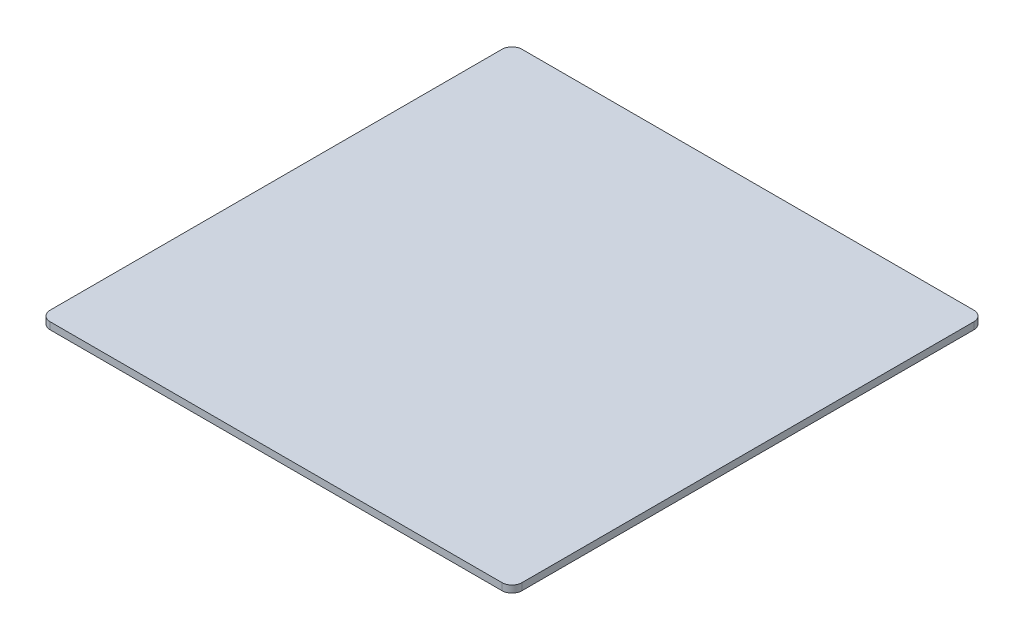
ISO-10303-21;
HEADER;
FILE_DESCRIPTION(('STEP AP214'),'2;1');
FILE_NAME('part.step','',(''),(''),'','','');
FILE_SCHEMA(('AUTOMOTIVE_DESIGN { 1 0 10303 214 1 1 1 1 }'));
ENDSEC;
DATA;
#1=APPLICATION_CONTEXT('core data for automotive mechanical design processes');
#2=APPLICATION_PROTOCOL_DEFINITION('international standard','automotive_design',2000,#1);
#3=PRODUCT_CONTEXT('',#1,'mechanical');
#4=PRODUCT('Part','Part','',(#3));
#5=PRODUCT_RELATED_PRODUCT_CATEGORY('part','',(#4));
#6=PRODUCT_DEFINITION_FORMATION('','',#4);
#7=PRODUCT_DEFINITION_CONTEXT('part definition',#1,'design');
#8=PRODUCT_DEFINITION('design','',#6,#7);
#9=PRODUCT_DEFINITION_SHAPE('','',#8);
#10=(LENGTH_UNIT() NAMED_UNIT(*) SI_UNIT(.MILLI.,.METRE.));
#11=(NAMED_UNIT(*) PLANE_ANGLE_UNIT() SI_UNIT($,.RADIAN.));
#12=(NAMED_UNIT(*) SI_UNIT($,.STERADIAN.) SOLID_ANGLE_UNIT());
#13=UNCERTAINTY_MEASURE_WITH_UNIT(LENGTH_MEASURE(1.E-05),#10,'distance_accuracy_value','');
#14=(GEOMETRIC_REPRESENTATION_CONTEXT(3) GLOBAL_UNCERTAINTY_ASSIGNED_CONTEXT((#13)) GLOBAL_UNIT_ASSIGNED_CONTEXT((#10,
#11,#12)) REPRESENTATION_CONTEXT('',''));
#15=CARTESIAN_POINT('',(0.,0.,0.));
#16=DIRECTION('',(0.,0.,1.));
#17=DIRECTION('',(1.,0.,0.));
#18=AXIS2_PLACEMENT_3D('',#15,#16,#17);
#19=CARTESIAN_POINT('',(85.,1.,85.));
#20=DIRECTION('',(0.,-1.,0.));
#21=DIRECTION('',(0.,0.,-1.));
#22=AXIS2_PLACEMENT_3D('',#19,#20,#21);
#23=PLANE('',#22);
#24=CARTESIAN_POINT('',(85.,1.,85.));
#25=DIRECTION('',(0.,-1.,0.));
#26=DIRECTION('',(0.,0.,-1.));
#27=AXIS2_PLACEMENT_3D('',#24,#25,#26);
#28=CIRCLE('',#27,2.);
#29=CARTESIAN_POINT('',(85.,1.,83.));
#30=VERTEX_POINT('',#29);
#31=EDGE_CURVE('E11',#30,#30,#28,.T.);
#32=ORIENTED_EDGE('',*,*,#31,.T.);
#33=EDGE_LOOP('',(#32));
#34=FACE_BOUND('',#33,.T.);
#35=ADVANCED_FACE('F38',(#34),#23,.T.);
#36=CARTESIAN_POINT('',(85.,1.,85.));
#37=DIRECTION('',(0.,-1.,0.));
#38=DIRECTION('',(0.,0.,-1.));
#39=AXIS2_PLACEMENT_3D('',#36,#37,#38);
#40=CYLINDRICAL_SURFACE('',#39,2.);
#41=ORIENTED_EDGE('',*,*,#31,.F.);
#42=EDGE_LOOP('',(#41));
#43=FACE_BOUND('',#42,.T.);
#44=CARTESIAN_POINT('',(85.,0.,85.));
#45=DIRECTION('',(0.,-1.,0.));
#46=DIRECTION('',(0.,0.,-1.));
#47=AXIS2_PLACEMENT_3D('',#44,#45,#46);
#48=CIRCLE('',#47,2.);
#49=CARTESIAN_POINT('',(85.,0.,83.));
#50=VERTEX_POINT('',#49);
#51=EDGE_CURVE('E46',#50,#50,#48,.T.);
#52=ORIENTED_EDGE('',*,*,#51,.T.);
#53=EDGE_LOOP('',(#52));
#54=FACE_BOUND('',#53,.T.);
#55=ADVANCED_FACE('F204',(#43,#54),#40,.F.);
#56=CARTESIAN_POINT('',(85.,1.,-85.));
#57=DIRECTION('',(0.,-1.,0.));
#58=DIRECTION('',(0.,0.,-1.));
#59=AXIS2_PLACEMENT_3D('',#56,#57,#58);
#60=PLANE('',#59);
#61=CARTESIAN_POINT('',(85.,1.,-85.));
#62=DIRECTION('',(0.,-1.,0.));
#63=DIRECTION('',(0.,0.,-1.));
#64=AXIS2_PLACEMENT_3D('',#61,#62,#63);
#65=CIRCLE('',#64,2.);
#66=CARTESIAN_POINT('',(85.,1.,-87.));
#67=VERTEX_POINT('',#66);
#68=EDGE_CURVE('E197',#67,#67,#65,.T.);
#69=ORIENTED_EDGE('',*,*,#68,.T.);
#70=EDGE_LOOP('',(#69));
#71=FACE_BOUND('',#70,.T.);
#72=ADVANCED_FACE('F229',(#71),#60,.T.);
#73=CARTESIAN_POINT('',(85.,1.,-85.));
#74=DIRECTION('',(0.,-1.,0.));
#75=DIRECTION('',(0.,0.,-1.));
#76=AXIS2_PLACEMENT_3D('',#73,#74,#75);
#77=CYLINDRICAL_SURFACE('',#76,2.);
#78=ORIENTED_EDGE('',*,*,#68,.F.);
#79=EDGE_LOOP('',(#78));
#80=FACE_BOUND('',#79,.T.);
#81=CARTESIAN_POINT('',(85.,0.,-85.));
#82=DIRECTION('',(0.,-1.,0.));
#83=DIRECTION('',(0.,0.,-1.));
#84=AXIS2_PLACEMENT_3D('',#81,#82,#83);
#85=CIRCLE('',#84,2.);
#86=CARTESIAN_POINT('',(85.,0.,-87.));
#87=VERTEX_POINT('',#86);
#88=EDGE_CURVE('E193',#87,#87,#85,.T.);
#89=ORIENTED_EDGE('',*,*,#88,.T.);
#90=EDGE_LOOP('',(#89));
#91=FACE_BOUND('',#90,.T.);
#92=ADVANCED_FACE('F235',(#80,#91),#77,.F.);
#93=CARTESIAN_POINT('',(-117.5,3.5,-117.5));
#94=DIRECTION('',(1.,0.,0.));
#95=DIRECTION('',(0.,0.,-1.));
#96=AXIS2_PLACEMENT_3D('',#93,#94,#95);
#97=PLANE('',#96);
#98=DIRECTION('',(0.,0.,1.));
#99=VECTOR('',#98,1.);
#100=CARTESIAN_POINT('',(-117.5,3.5,-117.5));
#101=LINE('',#100,#99);
#102=CARTESIAN_POINT('',(-117.5,3.5,-112.5));
#103=VERTEX_POINT('',#102);
#104=CARTESIAN_POINT('',(-117.5,3.5,112.5));
#105=VERTEX_POINT('',#104);
#106=EDGE_CURVE('E126',#103,#105,#101,.T.);
#107=ORIENTED_EDGE('',*,*,#106,.F.);
#108=DIRECTION('',(0.,-1.,0.));
#109=VECTOR('',#108,1.);
#110=CARTESIAN_POINT('',(-117.5,3.5,-112.5));
#111=LINE('',#110,#109);
#112=CARTESIAN_POINT('',(-117.5,0.,-112.5));
#113=VERTEX_POINT('',#112);
#114=EDGE_CURVE('E109',#103,#113,#111,.T.);
#115=ORIENTED_EDGE('',*,*,#114,.T.);
#116=DIRECTION('',(0.,0.,1.));
#117=VECTOR('',#116,1.);
#118=CARTESIAN_POINT('',(-117.5,0.,-117.5));
#119=LINE('',#118,#117);
#120=CARTESIAN_POINT('',(-117.5,0.,112.5));
#121=VERTEX_POINT('',#120);
#122=EDGE_CURVE('E123',#113,#121,#119,.T.);
#123=ORIENTED_EDGE('',*,*,#122,.T.);
#124=DIRECTION('',(0.,-1.,0.));
#125=VECTOR('',#124,1.);
#126=CARTESIAN_POINT('',(-117.5,3.5,112.5));
#127=LINE('',#126,#125);
#128=EDGE_CURVE('E129',#121,#105,#127,.F.);
#129=ORIENTED_EDGE('',*,*,#128,.T.);
#130=EDGE_LOOP('',(#107,#115,#123,#129));
#131=FACE_BOUND('',#130,.T.);
#132=ADVANCED_FACE('F122',(#131),#97,.F.);
#133=CARTESIAN_POINT('',(117.5,3.5,117.5));
#134=DIRECTION('',(0.,0.,-1.));
#135=DIRECTION('',(-1.,0.,0.));
#136=AXIS2_PLACEMENT_3D('',#133,#134,#135);
#137=PLANE('',#136);
#138=DIRECTION('',(1.,0.,0.));
#139=VECTOR('',#138,1.);
#140=CARTESIAN_POINT('',(117.5,0.,117.5));
#141=LINE('',#140,#139);
#142=CARTESIAN_POINT('',(-112.5,0.,117.5));
#143=VERTEX_POINT('',#142);
#144=CARTESIAN_POINT('',(112.5,0.,117.5));
#145=VERTEX_POINT('',#144);
#146=EDGE_CURVE('E135',#143,#145,#141,.T.);
#147=ORIENTED_EDGE('',*,*,#146,.T.);
#148=DIRECTION('',(0.,-1.,0.));
#149=VECTOR('',#148,1.);
#150=CARTESIAN_POINT('',(112.5,3.5,117.5));
#151=LINE('',#150,#149);
#152=CARTESIAN_POINT('',(112.5,3.5,117.5));
#153=VERTEX_POINT('',#152);
#154=EDGE_CURVE('E190',#145,#153,#151,.F.);
#155=ORIENTED_EDGE('',*,*,#154,.T.);
#156=DIRECTION('',(1.,0.,0.));
#157=VECTOR('',#156,1.);
#158=CARTESIAN_POINT('',(117.5,3.5,117.5));
#159=LINE('',#158,#157);
#160=CARTESIAN_POINT('',(-112.5,3.5,117.5));
#161=VERTEX_POINT('',#160);
#162=EDGE_CURVE('E274',#161,#153,#159,.T.);
#163=ORIENTED_EDGE('',*,*,#162,.F.);
#164=DIRECTION('',(0.,-1.,0.));
#165=VECTOR('',#164,1.);
#166=CARTESIAN_POINT('',(-112.5,3.5,117.5));
#167=LINE('',#166,#165);
#168=EDGE_CURVE('E186',#161,#143,#167,.T.);
#169=ORIENTED_EDGE('',*,*,#168,.T.);
#170=EDGE_LOOP('',(#147,#155,#163,#169));
#171=FACE_BOUND('',#170,.T.);
#172=ADVANCED_FACE('F255',(#171),#137,.F.);
#173=CARTESIAN_POINT('',(117.5,3.5,-117.5));
#174=DIRECTION('',(-1.,0.,0.));
#175=DIRECTION('',(0.,0.,1.));
#176=AXIS2_PLACEMENT_3D('',#173,#174,#175);
#177=PLANE('',#176);
#178=DIRECTION('',(0.,0.,-1.));
#179=VECTOR('',#178,1.);
#180=CARTESIAN_POINT('',(117.5,0.,-117.5));
#181=LINE('',#180,#179);
#182=CARTESIAN_POINT('',(117.5,0.,112.5));
#183=VERTEX_POINT('',#182);
#184=CARTESIAN_POINT('',(117.5,0.,-112.5));
#185=VERTEX_POINT('',#184);
#186=EDGE_CURVE('E141',#183,#185,#181,.T.);
#187=ORIENTED_EDGE('',*,*,#186,.T.);
#188=DIRECTION('',(0.,-1.,0.));
#189=VECTOR('',#188,1.);
#190=CARTESIAN_POINT('',(117.5,3.5,-112.5));
#191=LINE('',#190,#189);
#192=CARTESIAN_POINT('',(117.5,3.5,-112.5));
#193=VERTEX_POINT('',#192);
#194=EDGE_CURVE('E53',#185,#193,#191,.F.);
#195=ORIENTED_EDGE('',*,*,#194,.T.);
#196=DIRECTION('',(0.,0.,-1.));
#197=VECTOR('',#196,1.);
#198=CARTESIAN_POINT('',(117.5,3.5,-117.5));
#199=LINE('',#198,#197);
#200=CARTESIAN_POINT('',(117.5,3.5,112.5));
#201=VERTEX_POINT('',#200);
#202=EDGE_CURVE('E271',#201,#193,#199,.T.);
#203=ORIENTED_EDGE('',*,*,#202,.F.);
#204=DIRECTION('',(0.,-1.,0.));
#205=VECTOR('',#204,1.);
#206=CARTESIAN_POINT('',(117.5,3.5,112.5));
#207=LINE('',#206,#205);
#208=EDGE_CURVE('E180',#201,#183,#207,.T.);
#209=ORIENTED_EDGE('',*,*,#208,.T.);
#210=EDGE_LOOP('',(#187,#195,#203,#209));
#211=FACE_BOUND('',#210,.T.);
#212=ADVANCED_FACE('F258',(#211),#177,.F.);
#213=CARTESIAN_POINT('',(117.5,3.5,-117.5));
#214=DIRECTION('',(0.,0.,1.));
#215=DIRECTION('',(1.,0.,0.));
#216=AXIS2_PLACEMENT_3D('',#213,#214,#215);
#217=PLANE('',#216);
#218=DIRECTION('',(-1.,0.,0.));
#219=VECTOR('',#218,1.);
#220=CARTESIAN_POINT('',(117.5,0.,-117.5));
#221=LINE('',#220,#219);
#222=CARTESIAN_POINT('',(112.5,0.,-117.5));
#223=VERTEX_POINT('',#222);
#224=CARTESIAN_POINT('',(-112.5,0.,-117.5));
#225=VERTEX_POINT('',#224);
#226=EDGE_CURVE('E152',#223,#225,#221,.T.);
#227=ORIENTED_EDGE('',*,*,#226,.T.);
#228=DIRECTION('',(0.,-1.,0.));
#229=VECTOR('',#228,1.);
#230=CARTESIAN_POINT('',(-112.5,3.5,-117.5));
#231=LINE('',#230,#229);
#232=CARTESIAN_POINT('',(-112.5,3.5,-117.5));
#233=VERTEX_POINT('',#232);
#234=EDGE_CURVE('E110',#225,#233,#231,.F.);
#235=ORIENTED_EDGE('',*,*,#234,.T.);
#236=DIRECTION('',(-1.,0.,0.));
#237=VECTOR('',#236,1.);
#238=CARTESIAN_POINT('',(117.5,3.5,-117.5));
#239=LINE('',#238,#237);
#240=CARTESIAN_POINT('',(112.5,3.5,-117.5));
#241=VERTEX_POINT('',#240);
#242=EDGE_CURVE('E147',#241,#233,#239,.T.);
#243=ORIENTED_EDGE('',*,*,#242,.F.);
#244=DIRECTION('',(0.,-1.,0.));
#245=VECTOR('',#244,1.);
#246=CARTESIAN_POINT('',(112.5,3.5,-117.5));
#247=LINE('',#246,#245);
#248=EDGE_CURVE('E116',#241,#223,#247,.T.);
#249=ORIENTED_EDGE('',*,*,#248,.T.);
#250=EDGE_LOOP('',(#227,#235,#243,#249));
#251=FACE_BOUND('',#250,.T.);
#252=ADVANCED_FACE('F218',(#251),#217,.F.);
#253=CARTESIAN_POINT('',(0.,3.5,0.));
#254=DIRECTION('',(0.,-1.,0.));
#255=DIRECTION('',(0.,0.,-1.));
#256=AXIS2_PLACEMENT_3D('',#253,#254,#255);
#257=PLANE('',#256);
#258=ORIENTED_EDGE('',*,*,#242,.T.);
#259=CARTESIAN_POINT('',(-112.5,3.5,-112.5));
#260=DIRECTION('',(0.,-1.,0.));
#261=DIRECTION('',(0.,0.,-1.));
#262=AXIS2_PLACEMENT_3D('',#259,#260,#261);
#263=CIRCLE('',#262,5.);
#264=EDGE_CURVE('E177',#233,#103,#263,.F.);
#265=ORIENTED_EDGE('',*,*,#264,.T.);
#266=ORIENTED_EDGE('',*,*,#106,.T.);
#267=CARTESIAN_POINT('',(-112.5,3.5,112.5));
#268=DIRECTION('',(0.,-1.,0.));
#269=DIRECTION('',(0.,0.,-1.));
#270=AXIS2_PLACEMENT_3D('',#267,#268,#269);
#271=CIRCLE('',#270,5.);
#272=EDGE_CURVE('E169',#105,#161,#271,.F.);
#273=ORIENTED_EDGE('',*,*,#272,.T.);
#274=ORIENTED_EDGE('',*,*,#162,.T.);
#275=CARTESIAN_POINT('',(112.5,3.5,112.5));
#276=DIRECTION('',(0.,-1.,0.));
#277=DIRECTION('',(0.,0.,-1.));
#278=AXIS2_PLACEMENT_3D('',#275,#276,#277);
#279=CIRCLE('',#278,5.);
#280=EDGE_CURVE('E60',#153,#201,#279,.F.);
#281=ORIENTED_EDGE('',*,*,#280,.T.);
#282=ORIENTED_EDGE('',*,*,#202,.T.);
#283=CARTESIAN_POINT('',(112.5,3.5,-112.5));
#284=DIRECTION('',(0.,-1.,0.));
#285=DIRECTION('',(0.,0.,-1.));
#286=AXIS2_PLACEMENT_3D('',#283,#284,#285);
#287=CIRCLE('',#286,5.);
#288=EDGE_CURVE('E174',#193,#241,#287,.F.);
#289=ORIENTED_EDGE('',*,*,#288,.T.);
#290=EDGE_LOOP('',(#258,#265,#266,#273,#274,#281,#282,#289));
#291=FACE_BOUND('',#290,.T.);
#292=ADVANCED_FACE('F207',(#291),#257,.F.);
#293=CARTESIAN_POINT('',(0.,0.,0.));
#294=DIRECTION('',(0.,-1.,0.));
#295=DIRECTION('',(0.,0.,-1.));
#296=AXIS2_PLACEMENT_3D('',#293,#294,#295);
#297=PLANE('',#296);
#298=CARTESIAN_POINT('',(-85.,0.,85.));
#299=DIRECTION('',(0.,-1.,0.));
#300=DIRECTION('',(0.,0.,-1.));
#301=AXIS2_PLACEMENT_3D('',#298,#299,#300);
#302=CIRCLE('',#301,2.);
#303=CARTESIAN_POINT('',(-85.,0.,83.));
#304=VERTEX_POINT('',#303);
#305=EDGE_CURVE('E287',#304,#304,#302,.T.);
#306=ORIENTED_EDGE('',*,*,#305,.F.);
#307=EDGE_LOOP('',(#306));
#308=FACE_BOUND('',#307,.T.);
#309=CARTESIAN_POINT('',(-85.,0.,-85.));
#310=DIRECTION('',(0.,-1.,0.));
#311=DIRECTION('',(0.,0.,-1.));
#312=AXIS2_PLACEMENT_3D('',#309,#310,#311);
#313=CIRCLE('',#312,2.);
#314=CARTESIAN_POINT('',(-85.,0.,-87.));
#315=VERTEX_POINT('',#314);
#316=EDGE_CURVE('E144',#315,#315,#313,.T.);
#317=ORIENTED_EDGE('',*,*,#316,.F.);
#318=EDGE_LOOP('',(#317));
#319=FACE_BOUND('',#318,.T.);
#320=ORIENTED_EDGE('',*,*,#122,.F.);
#321=CARTESIAN_POINT('',(-112.5,0.,-112.5));
#322=DIRECTION('',(0.,-1.,0.));
#323=DIRECTION('',(0.,0.,-1.));
#324=AXIS2_PLACEMENT_3D('',#321,#322,#323);
#325=CIRCLE('',#324,5.);
#326=EDGE_CURVE('E105',#113,#225,#325,.T.);
#327=ORIENTED_EDGE('',*,*,#326,.T.);
#328=ORIENTED_EDGE('',*,*,#226,.F.);
#329=CARTESIAN_POINT('',(112.5,0.,-112.5));
#330=DIRECTION('',(0.,-1.,0.));
#331=DIRECTION('',(0.,0.,-1.));
#332=AXIS2_PLACEMENT_3D('',#329,#330,#331);
#333=CIRCLE('',#332,5.);
#334=EDGE_CURVE('E117',#223,#185,#333,.T.);
#335=ORIENTED_EDGE('',*,*,#334,.T.);
#336=ORIENTED_EDGE('',*,*,#186,.F.);
#337=CARTESIAN_POINT('',(112.5,0.,112.5));
#338=DIRECTION('',(0.,-1.,0.));
#339=DIRECTION('',(0.,0.,-1.));
#340=AXIS2_PLACEMENT_3D('',#337,#338,#339);
#341=CIRCLE('',#340,5.);
#342=EDGE_CURVE('E159',#183,#145,#341,.T.);
#343=ORIENTED_EDGE('',*,*,#342,.T.);
#344=ORIENTED_EDGE('',*,*,#146,.F.);
#345=CARTESIAN_POINT('',(-112.5,0.,112.5));
#346=DIRECTION('',(0.,-1.,0.));
#347=DIRECTION('',(0.,0.,-1.));
#348=AXIS2_PLACEMENT_3D('',#345,#346,#347);
#349=CIRCLE('',#348,5.);
#350=EDGE_CURVE('E128',#143,#121,#349,.T.);
#351=ORIENTED_EDGE('',*,*,#350,.T.);
#352=EDGE_LOOP('',(#320,#327,#328,#335,#336,#343,#344,#351));
#353=FACE_BOUND('',#352,.T.);
#354=ORIENTED_EDGE('',*,*,#88,.F.);
#355=EDGE_LOOP('',(#354));
#356=FACE_BOUND('',#355,.T.);
#357=ORIENTED_EDGE('',*,*,#51,.F.);
#358=EDGE_LOOP('',(#357));
#359=FACE_BOUND('',#358,.T.);
#360=ADVANCED_FACE('F131',(#308,#319,#353,#356,#359),#297,.T.);
#361=CARTESIAN_POINT('',(-112.5,3.5,-112.5));
#362=DIRECTION('',(0.,-1.,0.));
#363=DIRECTION('',(0.,0.,-1.));
#364=AXIS2_PLACEMENT_3D('',#361,#362,#363);
#365=CYLINDRICAL_SURFACE('',#364,5.);
#366=ORIENTED_EDGE('',*,*,#264,.F.);
#367=ORIENTED_EDGE('',*,*,#234,.F.);
#368=ORIENTED_EDGE('',*,*,#326,.F.);
#369=ORIENTED_EDGE('',*,*,#114,.F.);
#370=EDGE_LOOP('',(#366,#367,#368,#369));
#371=FACE_BOUND('',#370,.T.);
#372=ADVANCED_FACE('F108',(#371),#365,.T.);
#373=CARTESIAN_POINT('',(112.5,3.5,-112.5));
#374=DIRECTION('',(0.,-1.,0.));
#375=DIRECTION('',(0.,0.,-1.));
#376=AXIS2_PLACEMENT_3D('',#373,#374,#375);
#377=CYLINDRICAL_SURFACE('',#376,5.);
#378=ORIENTED_EDGE('',*,*,#288,.F.);
#379=ORIENTED_EDGE('',*,*,#194,.F.);
#380=ORIENTED_EDGE('',*,*,#334,.F.);
#381=ORIENTED_EDGE('',*,*,#248,.F.);
#382=EDGE_LOOP('',(#378,#379,#380,#381));
#383=FACE_BOUND('',#382,.T.);
#384=ADVANCED_FACE('F215',(#383),#377,.T.);
#385=CARTESIAN_POINT('',(112.5,3.5,112.5));
#386=DIRECTION('',(0.,-1.,0.));
#387=DIRECTION('',(0.,0.,-1.));
#388=AXIS2_PLACEMENT_3D('',#385,#386,#387);
#389=CYLINDRICAL_SURFACE('',#388,5.);
#390=ORIENTED_EDGE('',*,*,#280,.F.);
#391=ORIENTED_EDGE('',*,*,#154,.F.);
#392=ORIENTED_EDGE('',*,*,#342,.F.);
#393=ORIENTED_EDGE('',*,*,#208,.F.);
#394=EDGE_LOOP('',(#390,#391,#392,#393));
#395=FACE_BOUND('',#394,.T.);
#396=ADVANCED_FACE('F245',(#395),#389,.T.);
#397=CARTESIAN_POINT('',(-112.5,3.5,112.5));
#398=DIRECTION('',(0.,-1.,0.));
#399=DIRECTION('',(0.,0.,-1.));
#400=AXIS2_PLACEMENT_3D('',#397,#398,#399);
#401=CYLINDRICAL_SURFACE('',#400,5.);
#402=ORIENTED_EDGE('',*,*,#272,.F.);
#403=ORIENTED_EDGE('',*,*,#128,.F.);
#404=ORIENTED_EDGE('',*,*,#350,.F.);
#405=ORIENTED_EDGE('',*,*,#168,.F.);
#406=EDGE_LOOP('',(#402,#403,#404,#405));
#407=FACE_BOUND('',#406,.T.);
#408=ADVANCED_FACE('F242',(#407),#401,.T.);
#409=CARTESIAN_POINT('',(-85.,1.,-85.));
#410=DIRECTION('',(0.,-1.,0.));
#411=DIRECTION('',(0.,0.,-1.));
#412=AXIS2_PLACEMENT_3D('',#409,#410,#411);
#413=CYLINDRICAL_SURFACE('',#412,2.);
#414=CARTESIAN_POINT('',(-85.,1.,-85.));
#415=DIRECTION('',(0.,-1.,0.));
#416=DIRECTION('',(0.,0.,-1.));
#417=AXIS2_PLACEMENT_3D('',#414,#415,#416);
#418=CIRCLE('',#417,2.);
#419=CARTESIAN_POINT('',(-85.,1.,-87.));
#420=VERTEX_POINT('',#419);
#421=EDGE_CURVE('E136',#420,#420,#418,.T.);
#422=ORIENTED_EDGE('',*,*,#421,.F.);
#423=EDGE_LOOP('',(#422));
#424=FACE_BOUND('',#423,.T.);
#425=ORIENTED_EDGE('',*,*,#316,.T.);
#426=EDGE_LOOP('',(#425));
#427=FACE_BOUND('',#426,.T.);
#428=ADVANCED_FACE('F244',(#424,#427),#413,.F.);
#429=CARTESIAN_POINT('',(-85.,1.,-85.));
#430=DIRECTION('',(0.,-1.,0.));
#431=DIRECTION('',(0.,0.,-1.));
#432=AXIS2_PLACEMENT_3D('',#429,#430,#431);
#433=PLANE('',#432);
#434=ORIENTED_EDGE('',*,*,#421,.T.);
#435=EDGE_LOOP('',(#434));
#436=FACE_BOUND('',#435,.T.);
#437=ADVANCED_FACE('F294',(#436),#433,.T.);
#438=CARTESIAN_POINT('',(-85.,1.,85.));
#439=DIRECTION('',(0.,-1.,0.));
#440=DIRECTION('',(0.,0.,-1.));
#441=AXIS2_PLACEMENT_3D('',#438,#439,#440);
#442=CYLINDRICAL_SURFACE('',#441,2.);
#443=CARTESIAN_POINT('',(-85.,1.,85.));
#444=DIRECTION('',(0.,-1.,0.));
#445=DIRECTION('',(0.,0.,-1.));
#446=AXIS2_PLACEMENT_3D('',#443,#444,#445);
#447=CIRCLE('',#446,2.);
#448=CARTESIAN_POINT('',(-85.,1.,83.));
#449=VERTEX_POINT('',#448);
#450=EDGE_CURVE('E282',#449,#449,#447,.T.);
#451=ORIENTED_EDGE('',*,*,#450,.F.);
#452=EDGE_LOOP('',(#451));
#453=FACE_BOUND('',#452,.T.);
#454=ORIENTED_EDGE('',*,*,#305,.T.);
#455=EDGE_LOOP('',(#454));
#456=FACE_BOUND('',#455,.T.);
#457=ADVANCED_FACE('F291',(#453,#456),#442,.F.);
#458=CARTESIAN_POINT('',(-85.,1.,85.));
#459=DIRECTION('',(0.,-1.,0.));
#460=DIRECTION('',(0.,0.,-1.));
#461=AXIS2_PLACEMENT_3D('',#458,#459,#460);
#462=PLANE('',#461);
#463=ORIENTED_EDGE('',*,*,#450,.T.);
#464=EDGE_LOOP('',(#463));
#465=FACE_BOUND('',#464,.T.);
#466=ADVANCED_FACE('F293',(#465),#462,.T.);
#467=CLOSED_SHELL('',(#35,#55,#72,#92,#132,#172,#212,#252,#292,#360,#372,#384,#396,#408,#428,
#437,#457,#466));
#468=MANIFOLD_SOLID_BREP('B2',#467);
#469=ADVANCED_BREP_SHAPE_REPRESENTATION('',(#18,#468),#14);
#470=SHAPE_DEFINITION_REPRESENTATION(#9,#469);
ENDSEC;
END-ISO-10303-21;
